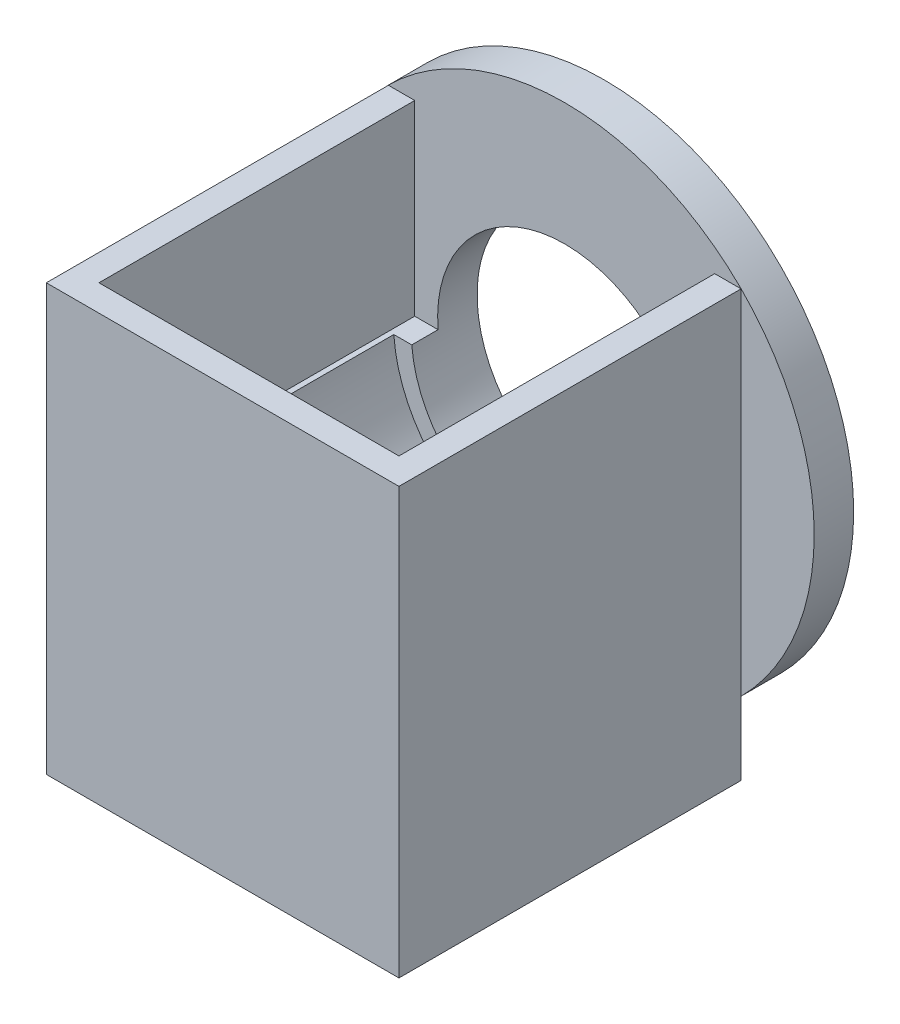
ISO-10303-21;
HEADER;
FILE_DESCRIPTION(('STEP AP214'),'2;1');
FILE_NAME('part.step','',(''),(''),'','','');
FILE_SCHEMA(('AUTOMOTIVE_DESIGN { 1 0 10303 214 1 1 1 1 }'));
ENDSEC;
DATA;
#1=APPLICATION_CONTEXT('core data for automotive mechanical design processes');
#2=APPLICATION_PROTOCOL_DEFINITION('international standard','automotive_design',2000,#1);
#3=PRODUCT_CONTEXT('',#1,'mechanical');
#4=PRODUCT('Part','Part','',(#3));
#5=PRODUCT_RELATED_PRODUCT_CATEGORY('part','',(#4));
#6=PRODUCT_DEFINITION_FORMATION('','',#4);
#7=PRODUCT_DEFINITION_CONTEXT('part definition',#1,'design');
#8=PRODUCT_DEFINITION('design','',#6,#7);
#9=PRODUCT_DEFINITION_SHAPE('','',#8);
#10=(LENGTH_UNIT() NAMED_UNIT(*) SI_UNIT(.MILLI.,.METRE.));
#11=(NAMED_UNIT(*) PLANE_ANGLE_UNIT() SI_UNIT($,.RADIAN.));
#12=(NAMED_UNIT(*) SI_UNIT($,.STERADIAN.) SOLID_ANGLE_UNIT());
#13=UNCERTAINTY_MEASURE_WITH_UNIT(LENGTH_MEASURE(1.E-05),#10,'distance_accuracy_value','');
#14=(GEOMETRIC_REPRESENTATION_CONTEXT(3) GLOBAL_UNCERTAINTY_ASSIGNED_CONTEXT((#13)) GLOBAL_UNIT_ASSIGNED_CONTEXT((#10,
#11,#12)) REPRESENTATION_CONTEXT('',''));
#15=CARTESIAN_POINT('',(0.,0.,0.));
#16=DIRECTION('',(0.,0.,1.));
#17=DIRECTION('',(1.,0.,0.));
#18=AXIS2_PLACEMENT_3D('',#15,#16,#17);
#19=CARTESIAN_POINT('',(0.,-1.99999999999999,0.));
#20=DIRECTION('',(0.,1.,0.));
#21=DIRECTION('',(0.,0.,1.));
#22=AXIS2_PLACEMENT_3D('',#19,#20,#21);
#23=PLANE('',#22);
#24=DIRECTION('',(-1.,0.,0.));
#25=VECTOR('',#24,1.);
#26=CARTESIAN_POINT('',(0.,-1.99999999999999,12.5));
#27=LINE('',#26,#25);
#28=CARTESIAN_POINT('',(27.4773088201883,-1.99999999999999,12.5));
#29=VERTEX_POINT('',#28);
#30=CARTESIAN_POINT('',(24.0670417791635,-1.99999999999999,12.5));
#31=VERTEX_POINT('',#30);
#32=EDGE_CURVE('E11',#29,#31,#27,.T.);
#33=ORIENTED_EDGE('',*,*,#32,.F.);
#34=DIRECTION('',(0.,0.,-1.));
#35=VECTOR('',#34,1.);
#36=CARTESIAN_POINT('',(27.4773088201883,-1.99999999999999,145.423167286758));
#37=LINE('',#36,#35);
#38=CARTESIAN_POINT('',(27.4773088201883,-1.99999999999999,67.5));
#39=VERTEX_POINT('',#38);
#40=EDGE_CURVE('E141',#39,#29,#37,.T.);
#41=ORIENTED_EDGE('',*,*,#40,.F.);
#42=DIRECTION('',(1.,0.,0.));
#43=VECTOR('',#42,1.);
#44=CARTESIAN_POINT('',(-28.5,-1.99999999999999,67.5));
#45=LINE('',#44,#43);
#46=CARTESIAN_POINT('',(28.5,-1.99999999999999,67.5));
#47=VERTEX_POINT('',#46);
#48=EDGE_CURVE('E360',#39,#47,#45,.T.);
#49=ORIENTED_EDGE('',*,*,#48,.T.);
#50=DIRECTION('',(0.,0.,-1.));
#51=VECTOR('',#50,1.);
#52=CARTESIAN_POINT('',(28.5,-1.99999999999999,7.5));
#53=LINE('',#52,#51);
#54=CARTESIAN_POINT('',(28.5,-1.99999999999999,7.5));
#55=VERTEX_POINT('',#54);
#56=EDGE_CURVE('E353',#47,#55,#53,.T.);
#57=ORIENTED_EDGE('',*,*,#56,.T.);
#58=DIRECTION('',(-1.,0.,0.));
#59=VECTOR('',#58,1.);
#60=CARTESIAN_POINT('',(-28.5,-1.99999999999999,7.50000000000001));
#61=LINE('',#60,#59);
#62=CARTESIAN_POINT('',(24.0670417791635,-1.99999999999999,7.5));
#63=VERTEX_POINT('',#62);
#64=EDGE_CURVE('E164',#55,#63,#61,.T.);
#65=ORIENTED_EDGE('',*,*,#64,.T.);
#66=DIRECTION('',(0.,0.,1.));
#67=VECTOR('',#66,1.);
#68=CARTESIAN_POINT('',(24.0670417791635,-1.99999999999999,-7.5));
#69=LINE('',#68,#67);
#70=EDGE_CURVE('E160',#63,#31,#69,.T.);
#71=ORIENTED_EDGE('',*,*,#70,.T.);
#72=EDGE_LOOP('',(#33,#41,#49,#57,#65,#71));
#73=FACE_BOUND('',#72,.T.);
#74=ADVANCED_FACE('F45',(#73),#23,.T.);
#75=CARTESIAN_POINT('',(0.,0.,-7.5));
#76=DIRECTION('',(0.,0.,1.));
#77=DIRECTION('',(1.,0.,0.));
#78=AXIS2_PLACEMENT_3D('',#75,#76,#77);
#79=CYLINDRICAL_SURFACE('',#78,24.15);
#80=CARTESIAN_POINT('',(0.,0.,0.));
#81=DIRECTION('',(0.,0.,1.));
#82=DIRECTION('',(1.,0.,0.));
#83=AXIS2_PLACEMENT_3D('',#80,#81,#82);
#84=CIRCLE('',#83,24.15);
#85=CARTESIAN_POINT('',(24.15,0.,0.));
#86=VERTEX_POINT('',#85);
#87=EDGE_CURVE('E230',#86,#86,#84,.T.);
#88=ORIENTED_EDGE('',*,*,#87,.F.);
#89=EDGE_LOOP('',(#88));
#90=FACE_BOUND('',#89,.T.);
#91=DIRECTION('',(0.,0.,1.));
#92=VECTOR('',#91,1.);
#93=CARTESIAN_POINT('',(-24.0670417791635,-1.99999999999999,-7.5));
#94=LINE('',#93,#92);
#95=CARTESIAN_POINT('',(-24.0670417791635,-1.99999999999999,12.5));
#96=VERTEX_POINT('',#95);
#97=CARTESIAN_POINT('',(-24.0670417791635,-1.99999999999999,7.50000000000001));
#98=VERTEX_POINT('',#97);
#99=EDGE_CURVE('E168',#96,#98,#94,.F.);
#100=ORIENTED_EDGE('',*,*,#99,.F.);
#101=CARTESIAN_POINT('',(0.,0.,12.5));
#102=DIRECTION('',(0.,0.,-1.));
#103=DIRECTION('',(-1.,0.,0.));
#104=AXIS2_PLACEMENT_3D('',#101,#102,#103);
#105=CIRCLE('',#104,24.15);
#106=EDGE_CURVE('E172',#31,#96,#105,.T.);
#107=ORIENTED_EDGE('',*,*,#106,.F.);
#108=ORIENTED_EDGE('',*,*,#70,.F.);
#109=CARTESIAN_POINT('',(0.,0.,7.5));
#110=DIRECTION('',(0.,0.,-1.));
#111=DIRECTION('',(-1.,0.,0.));
#112=AXIS2_PLACEMENT_3D('',#109,#110,#111);
#113=CIRCLE('',#112,24.15);
#114=EDGE_CURVE('E176',#63,#98,#113,.F.);
#115=ORIENTED_EDGE('',*,*,#114,.T.);
#116=EDGE_LOOP('',(#100,#107,#108,#115));
#117=FACE_BOUND('',#116,.T.);
#118=ADVANCED_FACE('F173',(#90,#117),#79,.F.);
#119=CARTESIAN_POINT('',(0.,0.,7.5));
#120=DIRECTION('',(0.,0.,-1.));
#121=DIRECTION('',(-1.,0.,0.));
#122=AXIS2_PLACEMENT_3D('',#119,#120,#121);
#123=CYLINDRICAL_SURFACE('',#122,47.4);
#124=CARTESIAN_POINT('',(0.,0.,7.5));
#125=DIRECTION('',(0.,0.,1.));
#126=DIRECTION('',(1.,0.,0.));
#127=AXIS2_PLACEMENT_3D('',#124,#125,#126);
#128=CIRCLE('',#127,47.4);
#129=CARTESIAN_POINT('',(-33.5,-33.5337143782194,7.5));
#130=VERTEX_POINT('',#129);
#131=CARTESIAN_POINT('',(0.,-47.4,7.5));
#132=VERTEX_POINT('',#131);
#133=EDGE_CURVE('E231',#130,#132,#128,.T.);
#134=ORIENTED_EDGE('',*,*,#133,.F.);
#135=CARTESIAN_POINT('',(33.5,-33.5337143782194,7.5));
#136=VERTEX_POINT('',#135);
#137=EDGE_CURVE('E236',#136,#130,#128,.T.);
#138=ORIENTED_EDGE('',*,*,#137,.F.);
#139=EDGE_CURVE('E235',#132,#136,#128,.T.);
#140=ORIENTED_EDGE('',*,*,#139,.F.);
#141=EDGE_LOOP('',(#134,#138,#140));
#142=FACE_BOUND('',#141,.T.);
#143=CARTESIAN_POINT('',(0.,0.,0.));
#144=DIRECTION('',(0.,0.,1.));
#145=DIRECTION('',(1.,0.,0.));
#146=AXIS2_PLACEMENT_3D('',#143,#144,#145);
#147=CIRCLE('',#146,47.4);
#148=CARTESIAN_POINT('',(47.4,0.,0.));
#149=VERTEX_POINT('',#148);
#150=EDGE_CURVE('E237',#149,#149,#147,.T.);
#151=ORIENTED_EDGE('',*,*,#150,.T.);
#152=EDGE_LOOP('',(#151));
#153=FACE_BOUND('',#152,.T.);
#154=ADVANCED_FACE('F47',(#142,#153),#123,.T.);
#155=CARTESIAN_POINT('',(0.,0.,7.5));
#156=DIRECTION('',(0.,0.,1.));
#157=DIRECTION('',(1.,0.,0.));
#158=AXIS2_PLACEMENT_3D('',#155,#156,#157);
#159=PLANE('',#158);
#160=DIRECTION('',(0.,1.,0.));
#161=VECTOR('',#160,1.);
#162=CARTESIAN_POINT('',(33.5,-33.5,7.5));
#163=LINE('',#162,#161);
#164=CARTESIAN_POINT('',(33.5,33.5,7.5));
#165=VERTEX_POINT('',#164);
#166=EDGE_CURVE('E214',#136,#165,#163,.T.);
#167=ORIENTED_EDGE('',*,*,#166,.F.);
#168=ORIENTED_EDGE('',*,*,#137,.T.);
#169=DIRECTION('',(0.,-1.,0.));
#170=VECTOR('',#169,1.);
#171=CARTESIAN_POINT('',(-33.5,-47.4,7.5));
#172=LINE('',#171,#170);
#173=CARTESIAN_POINT('',(-33.5,33.5,7.5));
#174=VERTEX_POINT('',#173);
#175=EDGE_CURVE('E202',#174,#130,#172,.T.);
#176=ORIENTED_EDGE('',*,*,#175,.F.);
#177=DIRECTION('',(-1.,0.,0.));
#178=VECTOR('',#177,1.);
#179=CARTESIAN_POINT('',(-33.5,33.5,7.5));
#180=LINE('',#179,#178);
#181=CARTESIAN_POINT('',(-28.5,33.5,7.50000000000001));
#182=VERTEX_POINT('',#181);
#183=EDGE_CURVE('E175',#182,#174,#180,.T.);
#184=ORIENTED_EDGE('',*,*,#183,.F.);
#185=DIRECTION('',(0.,1.,0.));
#186=VECTOR('',#185,1.);
#187=CARTESIAN_POINT('',(-28.5,-1.99999999999999,7.50000000000001));
#188=LINE('',#187,#186);
#189=CARTESIAN_POINT('',(-28.5,-1.99999999999999,7.50000000000001));
#190=VERTEX_POINT('',#189);
#191=EDGE_CURVE('E169',#190,#182,#188,.T.);
#192=ORIENTED_EDGE('',*,*,#191,.F.);
#193=EDGE_CURVE('E350',#98,#190,#61,.T.);
#194=ORIENTED_EDGE('',*,*,#193,.F.);
#195=ORIENTED_EDGE('',*,*,#114,.F.);
#196=ORIENTED_EDGE('',*,*,#64,.F.);
#197=DIRECTION('',(0.,1.,0.));
#198=VECTOR('',#197,1.);
#199=CARTESIAN_POINT('',(28.5,-1.99999999999999,7.5));
#200=LINE('',#199,#198);
#201=CARTESIAN_POINT('',(28.5,33.5,7.5));
#202=VERTEX_POINT('',#201);
#203=EDGE_CURVE('E338',#55,#202,#200,.T.);
#204=ORIENTED_EDGE('',*,*,#203,.T.);
#205=EDGE_CURVE('E180',#165,#202,#180,.T.);
#206=ORIENTED_EDGE('',*,*,#205,.F.);
#207=EDGE_LOOP('',(#167,#168,#176,#184,#192,#194,#195,#196,#204,#206));
#208=FACE_BOUND('',#207,.T.);
#209=ADVANCED_FACE('F254',(#208),#159,.T.);
#210=CARTESIAN_POINT('',(0.,0.,0.));
#211=DIRECTION('',(0.,0.,1.));
#212=DIRECTION('',(1.,0.,0.));
#213=AXIS2_PLACEMENT_3D('',#210,#211,#212);
#214=PLANE('',#213);
#215=ORIENTED_EDGE('',*,*,#87,.T.);
#216=EDGE_LOOP('',(#215));
#217=FACE_BOUND('',#216,.T.);
#218=ORIENTED_EDGE('',*,*,#150,.F.);
#219=EDGE_LOOP('',(#218));
#220=FACE_BOUND('',#219,.T.);
#221=ADVANCED_FACE('F244',(#217,#220),#214,.F.);
#222=CARTESIAN_POINT('',(0.,0.,72.5));
#223=DIRECTION('',(0.,0.,1.));
#224=DIRECTION('',(1.,0.,0.));
#225=AXIS2_PLACEMENT_3D('',#222,#223,#224);
#226=PLANE('',#225);
#227=DIRECTION('',(-1.,0.,0.));
#228=VECTOR('',#227,1.);
#229=CARTESIAN_POINT('',(0.,33.5,72.5));
#230=LINE('',#229,#228);
#231=CARTESIAN_POINT('',(33.5,33.5,72.5));
#232=VERTEX_POINT('',#231);
#233=CARTESIAN_POINT('',(-33.5,33.5,72.5));
#234=VERTEX_POINT('',#233);
#235=EDGE_CURVE('E185',#232,#234,#230,.T.);
#236=ORIENTED_EDGE('',*,*,#235,.T.);
#237=DIRECTION('',(0.,-1.,0.));
#238=VECTOR('',#237,1.);
#239=CARTESIAN_POINT('',(-33.5,-33.5,72.5));
#240=LINE('',#239,#238);
#241=CARTESIAN_POINT('',(-33.5,-47.4,72.5));
#242=VERTEX_POINT('',#241);
#243=EDGE_CURVE('E188',#234,#242,#240,.T.);
#244=ORIENTED_EDGE('',*,*,#243,.T.);
#245=DIRECTION('',(1.,0.,0.));
#246=VECTOR('',#245,1.);
#247=CARTESIAN_POINT('',(-33.5,-47.4,72.5));
#248=LINE('',#247,#246);
#249=CARTESIAN_POINT('',(33.5,-47.4,72.5));
#250=VERTEX_POINT('',#249);
#251=EDGE_CURVE('E192',#242,#250,#248,.T.);
#252=ORIENTED_EDGE('',*,*,#251,.T.);
#253=DIRECTION('',(0.,1.,0.));
#254=VECTOR('',#253,1.);
#255=CARTESIAN_POINT('',(33.5,-47.4,72.5));
#256=LINE('',#255,#254);
#257=EDGE_CURVE('E195',#250,#232,#256,.T.);
#258=ORIENTED_EDGE('',*,*,#257,.T.);
#259=EDGE_LOOP('',(#236,#244,#252,#258));
#260=FACE_BOUND('',#259,.T.);
#261=ADVANCED_FACE('F265',(#260),#226,.T.);
#262=CARTESIAN_POINT('',(33.5,-33.5,72.5));
#263=DIRECTION('',(-1.,0.,0.));
#264=DIRECTION('',(0.,0.,1.));
#265=AXIS2_PLACEMENT_3D('',#262,#263,#264);
#266=PLANE('',#265);
#267=CARTESIAN_POINT('',(33.5,-47.4,7.5));
#268=VERTEX_POINT('',#267);
#269=EDGE_CURVE('E189',#268,#136,#163,.T.);
#270=ORIENTED_EDGE('',*,*,#269,.T.);
#271=ORIENTED_EDGE('',*,*,#166,.T.);
#272=DIRECTION('',(0.,0.,-1.));
#273=VECTOR('',#272,1.);
#274=CARTESIAN_POINT('',(33.5,33.5,72.5));
#275=LINE('',#274,#273);
#276=EDGE_CURVE('E197',#232,#165,#275,.T.);
#277=ORIENTED_EDGE('',*,*,#276,.F.);
#278=ORIENTED_EDGE('',*,*,#257,.F.);
#279=DIRECTION('',(0.,0.,-1.));
#280=VECTOR('',#279,1.);
#281=CARTESIAN_POINT('',(33.5,-47.4,72.5));
#282=LINE('',#281,#280);
#283=EDGE_CURVE('E218',#250,#268,#282,.T.);
#284=ORIENTED_EDGE('',*,*,#283,.T.);
#285=EDGE_LOOP('',(#270,#271,#277,#278,#284));
#286=FACE_BOUND('',#285,.T.);
#287=ADVANCED_FACE('F269',(#286),#266,.F.);
#288=CARTESIAN_POINT('',(-33.5,-47.4,72.5));
#289=DIRECTION('',(0.,1.,0.));
#290=DIRECTION('',(0.,0.,1.));
#291=AXIS2_PLACEMENT_3D('',#288,#289,#290);
#292=PLANE('',#291);
#293=DIRECTION('',(1.,0.,0.));
#294=VECTOR('',#293,1.);
#295=CARTESIAN_POINT('',(-33.5,-47.4,7.5));
#296=LINE('',#295,#294);
#297=CARTESIAN_POINT('',(-33.5,-47.4,7.5));
#298=VERTEX_POINT('',#297);
#299=EDGE_CURVE('E207',#298,#132,#296,.T.);
#300=ORIENTED_EDGE('',*,*,#299,.T.);
#301=EDGE_CURVE('E206',#132,#268,#296,.T.);
#302=ORIENTED_EDGE('',*,*,#301,.T.);
#303=ORIENTED_EDGE('',*,*,#283,.F.);
#304=ORIENTED_EDGE('',*,*,#251,.F.);
#305=DIRECTION('',(0.,0.,-1.));
#306=VECTOR('',#305,1.);
#307=CARTESIAN_POINT('',(-33.5,-47.4,72.5));
#308=LINE('',#307,#306);
#309=EDGE_CURVE('E222',#242,#298,#308,.T.);
#310=ORIENTED_EDGE('',*,*,#309,.T.);
#311=EDGE_LOOP('',(#300,#302,#303,#304,#310));
#312=FACE_BOUND('',#311,.T.);
#313=ADVANCED_FACE('F275',(#312),#292,.F.);
#314=CARTESIAN_POINT('',(-33.5,-47.4,72.5));
#315=DIRECTION('',(1.,0.,0.));
#316=DIRECTION('',(0.,1.,0.));
#317=AXIS2_PLACEMENT_3D('',#314,#315,#316);
#318=PLANE('',#317);
#319=ORIENTED_EDGE('',*,*,#175,.T.);
#320=EDGE_CURVE('E201',#130,#298,#172,.T.);
#321=ORIENTED_EDGE('',*,*,#320,.T.);
#322=ORIENTED_EDGE('',*,*,#309,.F.);
#323=ORIENTED_EDGE('',*,*,#243,.F.);
#324=DIRECTION('',(0.,0.,-1.));
#325=VECTOR('',#324,1.);
#326=CARTESIAN_POINT('',(-33.5,33.5,72.5));
#327=LINE('',#326,#325);
#328=EDGE_CURVE('E226',#234,#174,#327,.T.);
#329=ORIENTED_EDGE('',*,*,#328,.T.);
#330=EDGE_LOOP('',(#319,#321,#322,#323,#329));
#331=FACE_BOUND('',#330,.T.);
#332=ADVANCED_FACE('F288',(#331),#318,.F.);
#333=CARTESIAN_POINT('',(-33.5,33.5,72.5));
#334=DIRECTION('',(0.,-1.,0.));
#335=DIRECTION('',(0.,0.,-1.));
#336=AXIS2_PLACEMENT_3D('',#333,#334,#335);
#337=PLANE('',#336);
#338=DIRECTION('',(1.,0.,0.));
#339=VECTOR('',#338,1.);
#340=CARTESIAN_POINT('',(-28.5,33.5,67.5));
#341=LINE('',#340,#339);
#342=CARTESIAN_POINT('',(-28.5,33.5,67.5));
#343=VERTEX_POINT('',#342);
#344=CARTESIAN_POINT('',(28.5,33.5,67.5));
#345=VERTEX_POINT('',#344);
#346=EDGE_CURVE('E323',#343,#345,#341,.T.);
#347=ORIENTED_EDGE('',*,*,#346,.F.);
#348=DIRECTION('',(0.,0.,1.));
#349=VECTOR('',#348,1.);
#350=CARTESIAN_POINT('',(-28.5,33.5,7.50000000000001));
#351=LINE('',#350,#349);
#352=EDGE_CURVE('E69',#182,#343,#351,.T.);
#353=ORIENTED_EDGE('',*,*,#352,.F.);
#354=ORIENTED_EDGE('',*,*,#183,.T.);
#355=ORIENTED_EDGE('',*,*,#328,.F.);
#356=ORIENTED_EDGE('',*,*,#235,.F.);
#357=ORIENTED_EDGE('',*,*,#276,.T.);
#358=ORIENTED_EDGE('',*,*,#205,.T.);
#359=DIRECTION('',(0.,0.,-1.));
#360=VECTOR('',#359,1.);
#361=CARTESIAN_POINT('',(28.5,33.5,7.5));
#362=LINE('',#361,#360);
#363=EDGE_CURVE('E327',#345,#202,#362,.T.);
#364=ORIENTED_EDGE('',*,*,#363,.F.);
#365=EDGE_LOOP('',(#347,#353,#354,#355,#356,#357,#358,#364));
#366=FACE_BOUND('',#365,.T.);
#367=ADVANCED_FACE('F260',(#366),#337,.F.);
#368=CARTESIAN_POINT('',(0.,0.,7.5));
#369=DIRECTION('',(0.,0.,1.));
#370=DIRECTION('',(1.,0.,0.));
#371=AXIS2_PLACEMENT_3D('',#368,#369,#370);
#372=PLANE('',#371);
#373=ORIENTED_EDGE('',*,*,#301,.F.);
#374=ORIENTED_EDGE('',*,*,#139,.T.);
#375=ORIENTED_EDGE('',*,*,#269,.F.);
#376=EDGE_LOOP('',(#373,#374,#375));
#377=FACE_BOUND('',#376,.T.);
#378=ADVANCED_FACE('F284',(#377),#372,.F.);
#379=ORIENTED_EDGE('',*,*,#320,.F.);
#380=ORIENTED_EDGE('',*,*,#133,.T.);
#381=ORIENTED_EDGE('',*,*,#299,.F.);
#382=EDGE_LOOP('',(#379,#380,#381));
#383=FACE_BOUND('',#382,.T.);
#384=ADVANCED_FACE('F282',(#383),#372,.F.);
#385=CARTESIAN_POINT('',(-27.4773088201883,-1.99999999999999,12.5));
#386=VERTEX_POINT('',#385);
#387=EDGE_CURVE('E49',#96,#386,#27,.T.);
#388=ORIENTED_EDGE('',*,*,#387,.F.);
#389=ORIENTED_EDGE('',*,*,#99,.T.);
#390=ORIENTED_EDGE('',*,*,#193,.T.);
#391=DIRECTION('',(0.,0.,1.));
#392=VECTOR('',#391,1.);
#393=CARTESIAN_POINT('',(-28.5,-1.99999999999999,7.50000000000001));
#394=LINE('',#393,#392);
#395=CARTESIAN_POINT('',(-28.5,-1.99999999999999,67.5));
#396=VERTEX_POINT('',#395);
#397=EDGE_CURVE('E335',#190,#396,#394,.T.);
#398=ORIENTED_EDGE('',*,*,#397,.T.);
#399=CARTESIAN_POINT('',(-27.4773088201883,-1.99999999999999,67.5));
#400=VERTEX_POINT('',#399);
#401=EDGE_CURVE('E356',#396,#400,#45,.T.);
#402=ORIENTED_EDGE('',*,*,#401,.T.);
#403=DIRECTION('',(0.,0.,-1.));
#404=VECTOR('',#403,1.);
#405=CARTESIAN_POINT('',(-27.4773088201883,-1.99999999999999,145.423167286758));
#406=LINE('',#405,#404);
#407=EDGE_CURVE('E149',#386,#400,#406,.F.);
#408=ORIENTED_EDGE('',*,*,#407,.F.);
#409=EDGE_LOOP('',(#388,#389,#390,#398,#402,#408));
#410=FACE_BOUND('',#409,.T.);
#411=ADVANCED_FACE('F257',(#410),#23,.T.);
#412=CARTESIAN_POINT('',(-28.5,-1.99999999999999,7.50000000000001));
#413=DIRECTION('',(-1.,0.,0.));
#414=DIRECTION('',(0.,0.,1.));
#415=AXIS2_PLACEMENT_3D('',#412,#413,#414);
#416=PLANE('',#415);
#417=ORIENTED_EDGE('',*,*,#352,.T.);
#418=DIRECTION('',(0.,1.,0.));
#419=VECTOR('',#418,1.);
#420=CARTESIAN_POINT('',(-28.5,-1.99999999999999,67.5));
#421=LINE('',#420,#419);
#422=EDGE_CURVE('E344',#396,#343,#421,.T.);
#423=ORIENTED_EDGE('',*,*,#422,.F.);
#424=ORIENTED_EDGE('',*,*,#397,.F.);
#425=ORIENTED_EDGE('',*,*,#191,.T.);
#426=EDGE_LOOP('',(#417,#423,#424,#425));
#427=FACE_BOUND('',#426,.T.);
#428=ADVANCED_FACE('F280',(#427),#416,.F.);
#429=CARTESIAN_POINT('',(28.5,-1.99999999999999,7.5));
#430=DIRECTION('',(1.,0.,0.));
#431=DIRECTION('',(0.,0.,-1.));
#432=AXIS2_PLACEMENT_3D('',#429,#430,#431);
#433=PLANE('',#432);
#434=ORIENTED_EDGE('',*,*,#363,.T.);
#435=ORIENTED_EDGE('',*,*,#203,.F.);
#436=ORIENTED_EDGE('',*,*,#56,.F.);
#437=DIRECTION('',(0.,1.,0.));
#438=VECTOR('',#437,1.);
#439=CARTESIAN_POINT('',(28.5,-1.99999999999999,67.5));
#440=LINE('',#439,#438);
#441=EDGE_CURVE('E341',#47,#345,#440,.T.);
#442=ORIENTED_EDGE('',*,*,#441,.T.);
#443=EDGE_LOOP('',(#434,#435,#436,#442));
#444=FACE_BOUND('',#443,.T.);
#445=ADVANCED_FACE('F373',(#444),#433,.F.);
#446=CARTESIAN_POINT('',(-28.5,-1.99999999999999,67.5));
#447=DIRECTION('',(0.,0.,1.));
#448=DIRECTION('',(1.,0.,0.));
#449=AXIS2_PLACEMENT_3D('',#446,#447,#448);
#450=PLANE('',#449);
#451=ORIENTED_EDGE('',*,*,#48,.F.);
#452=CARTESIAN_POINT('',(0.,0.,67.5));
#453=DIRECTION('',(0.,0.,1.));
#454=DIRECTION('',(1.,0.,0.));
#455=AXIS2_PLACEMENT_3D('',#452,#453,#454);
#456=CIRCLE('',#455,27.55);
#457=EDGE_CURVE('E144',#39,#400,#456,.F.);
#458=ORIENTED_EDGE('',*,*,#457,.T.);
#459=ORIENTED_EDGE('',*,*,#401,.F.);
#460=ORIENTED_EDGE('',*,*,#422,.T.);
#461=ORIENTED_EDGE('',*,*,#346,.T.);
#462=ORIENTED_EDGE('',*,*,#441,.F.);
#463=EDGE_LOOP('',(#451,#458,#459,#460,#461,#462));
#464=FACE_BOUND('',#463,.T.);
#465=ADVANCED_FACE('F370',(#464),#450,.F.);
#466=CARTESIAN_POINT('',(0.,0.,12.5));
#467=DIRECTION('',(0.,0.,-1.));
#468=DIRECTION('',(-1.,0.,0.));
#469=AXIS2_PLACEMENT_3D('',#466,#467,#468);
#470=PLANE('',#469);
#471=ORIENTED_EDGE('',*,*,#387,.T.);
#472=CARTESIAN_POINT('',(0.,0.,12.5));
#473=DIRECTION('',(0.,0.,-1.));
#474=DIRECTION('',(-1.,0.,0.));
#475=AXIS2_PLACEMENT_3D('',#472,#473,#474);
#476=CIRCLE('',#475,27.55);
#477=EDGE_CURVE('E61',#29,#386,#476,.T.);
#478=ORIENTED_EDGE('',*,*,#477,.F.);
#479=ORIENTED_EDGE('',*,*,#32,.T.);
#480=ORIENTED_EDGE('',*,*,#106,.T.);
#481=EDGE_LOOP('',(#471,#478,#479,#480));
#482=FACE_BOUND('',#481,.T.);
#483=ADVANCED_FACE('F152',(#482),#470,.F.);
#484=CARTESIAN_POINT('',(0.,0.,145.423167286758));
#485=DIRECTION('',(0.,0.,-1.));
#486=DIRECTION('',(-1.,0.,0.));
#487=AXIS2_PLACEMENT_3D('',#484,#485,#486);
#488=CYLINDRICAL_SURFACE('',#487,27.55);
#489=ORIENTED_EDGE('',*,*,#40,.T.);
#490=ORIENTED_EDGE('',*,*,#477,.T.);
#491=ORIENTED_EDGE('',*,*,#407,.T.);
#492=ORIENTED_EDGE('',*,*,#457,.F.);
#493=EDGE_LOOP('',(#489,#490,#491,#492));
#494=FACE_BOUND('',#493,.T.);
#495=ADVANCED_FACE('F142',(#494),#488,.F.);
#496=CLOSED_SHELL('',(#74,#118,#154,#209,#221,#261,#287,#313,#332,#367,#378,#384,#411,#428,#445,
#465,#483,#495));
#497=MANIFOLD_SOLID_BREP('B2',#496);
#498=ADVANCED_BREP_SHAPE_REPRESENTATION('',(#18,#497),#14);
#499=SHAPE_DEFINITION_REPRESENTATION(#9,#498);
ENDSEC;
END-ISO-10303-21;
